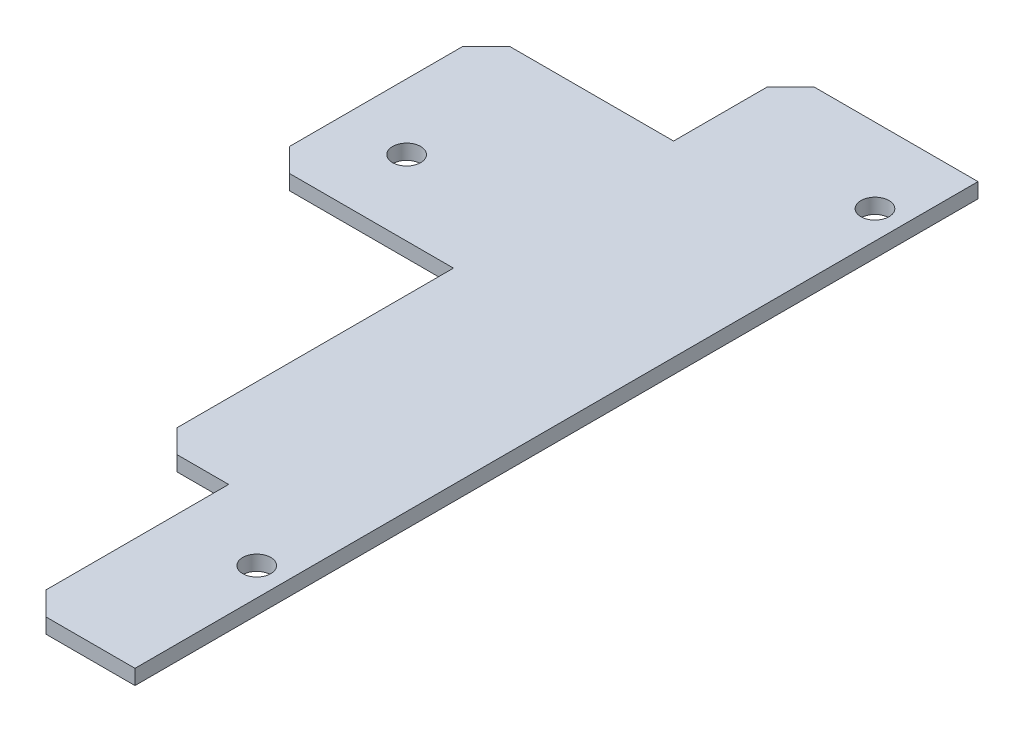
ISO-10303-21;
HEADER;
FILE_DESCRIPTION(('STEP AP214'),'2;1');
FILE_NAME('part.step','',(''),(''),'','','');
FILE_SCHEMA(('AUTOMOTIVE_DESIGN { 1 0 10303 214 1 1 1 1 }'));
ENDSEC;
DATA;
#1=APPLICATION_CONTEXT('core data for automotive mechanical design processes');
#2=APPLICATION_PROTOCOL_DEFINITION('international standard','automotive_design',2000,#1);
#3=PRODUCT_CONTEXT('',#1,'mechanical');
#4=PRODUCT('Part','Part','',(#3));
#5=PRODUCT_RELATED_PRODUCT_CATEGORY('part','',(#4));
#6=PRODUCT_DEFINITION_FORMATION('','',#4);
#7=PRODUCT_DEFINITION_CONTEXT('part definition',#1,'design');
#8=PRODUCT_DEFINITION('design','',#6,#7);
#9=PRODUCT_DEFINITION_SHAPE('','',#8);
#10=(LENGTH_UNIT() NAMED_UNIT(*) SI_UNIT(.MILLI.,.METRE.));
#11=(NAMED_UNIT(*) PLANE_ANGLE_UNIT() SI_UNIT($,.RADIAN.));
#12=(NAMED_UNIT(*) SI_UNIT($,.STERADIAN.) SOLID_ANGLE_UNIT());
#13=UNCERTAINTY_MEASURE_WITH_UNIT(LENGTH_MEASURE(1.E-05),#10,'distance_accuracy_value','');
#14=(GEOMETRIC_REPRESENTATION_CONTEXT(3) GLOBAL_UNCERTAINTY_ASSIGNED_CONTEXT((#13)) GLOBAL_UNIT_ASSIGNED_CONTEXT((#10,
#11,#12)) REPRESENTATION_CONTEXT('',''));
#15=CARTESIAN_POINT('',(0.,0.,0.));
#16=DIRECTION('',(0.,0.,1.));
#17=DIRECTION('',(1.,0.,0.));
#18=AXIS2_PLACEMENT_3D('',#15,#16,#17);
#19=CARTESIAN_POINT('',(-20.,1.6,-36.));
#20=DIRECTION('',(1.,0.,0.));
#21=DIRECTION('',(0.,0.,-1.));
#22=AXIS2_PLACEMENT_3D('',#19,#20,#21);
#23=PLANE('',#22);
#24=DIRECTION('',(0.,0.,1.));
#25=VECTOR('',#24,1.);
#26=CARTESIAN_POINT('',(-20.,1.6,-36.));
#27=LINE('',#26,#25);
#28=CARTESIAN_POINT('',(-20.,1.6,-21.));
#29=VERTEX_POINT('',#28);
#30=CARTESIAN_POINT('',(-20.,1.6,-2.5));
#31=VERTEX_POINT('',#30);
#32=EDGE_CURVE('E189',#29,#31,#27,.T.);
#33=ORIENTED_EDGE('',*,*,#32,.F.);
#34=DIRECTION('',(0.,-1.,0.));
#35=VECTOR('',#34,1.);
#36=CARTESIAN_POINT('',(-20.,1.6,-21.));
#37=LINE('',#36,#35);
#38=CARTESIAN_POINT('',(-20.,0.,-21.));
#39=VERTEX_POINT('',#38);
#40=EDGE_CURVE('E55',#29,#39,#37,.T.);
#41=ORIENTED_EDGE('',*,*,#40,.T.);
#42=DIRECTION('',(0.,0.,1.));
#43=VECTOR('',#42,1.);
#44=CARTESIAN_POINT('',(-20.,0.,-36.));
#45=LINE('',#44,#43);
#46=CARTESIAN_POINT('',(-20.,0.,-2.5));
#47=VERTEX_POINT('',#46);
#48=EDGE_CURVE('E186',#39,#47,#45,.T.);
#49=ORIENTED_EDGE('',*,*,#48,.T.);
#50=DIRECTION('',(0.,1.,0.));
#51=VECTOR('',#50,1.);
#52=CARTESIAN_POINT('',(-20.,1.6,-2.5));
#53=LINE('',#52,#51);
#54=EDGE_CURVE('E262',#47,#31,#53,.T.);
#55=ORIENTED_EDGE('',*,*,#54,.T.);
#56=EDGE_LOOP('',(#33,#41,#49,#55));
#57=FACE_BOUND('',#56,.T.);
#58=ADVANCED_FACE('F33',(#57),#23,.F.);
#59=CARTESIAN_POINT('',(-20.,1.6,0.));
#60=DIRECTION('',(0.,0.,-1.));
#61=DIRECTION('',(-1.,0.,0.));
#62=AXIS2_PLACEMENT_3D('',#59,#60,#61);
#63=PLANE('',#62);
#64=DIRECTION('',(1.,0.,0.));
#65=VECTOR('',#64,1.);
#66=CARTESIAN_POINT('',(-20.,1.6,0.));
#67=LINE('',#66,#65);
#68=CARTESIAN_POINT('',(-17.5,1.6,0.));
#69=VERTEX_POINT('',#68);
#70=CARTESIAN_POINT('',(0.,1.6,0.));
#71=VERTEX_POINT('',#70);
#72=EDGE_CURVE('E192',#69,#71,#67,.T.);
#73=ORIENTED_EDGE('',*,*,#72,.F.);
#74=DIRECTION('',(0.,-1.,0.));
#75=VECTOR('',#74,1.);
#76=CARTESIAN_POINT('',(-17.5,1.6,0.));
#77=LINE('',#76,#75);
#78=CARTESIAN_POINT('',(-17.5,0.,0.));
#79=VERTEX_POINT('',#78);
#80=EDGE_CURVE('E11',#69,#79,#77,.T.);
#81=ORIENTED_EDGE('',*,*,#80,.T.);
#82=DIRECTION('',(1.,0.,0.));
#83=VECTOR('',#82,1.);
#84=CARTESIAN_POINT('',(-20.,0.,0.));
#85=LINE('',#84,#83);
#86=CARTESIAN_POINT('',(0.,0.,0.));
#87=VERTEX_POINT('',#86);
#88=EDGE_CURVE('E211',#79,#87,#85,.T.);
#89=ORIENTED_EDGE('',*,*,#88,.T.);
#90=DIRECTION('',(0.,-1.,0.));
#91=VECTOR('',#90,1.);
#92=CARTESIAN_POINT('',(0.,1.6,0.));
#93=LINE('',#92,#91);
#94=EDGE_CURVE('E235',#71,#87,#93,.T.);
#95=ORIENTED_EDGE('',*,*,#94,.F.);
#96=EDGE_LOOP('',(#73,#81,#89,#95));
#97=FACE_BOUND('',#96,.T.);
#98=ADVANCED_FACE('F324',(#97),#63,.F.);
#99=CARTESIAN_POINT('',(0.,1.6,0.));
#100=DIRECTION('',(1.,0.,0.));
#101=DIRECTION('',(0.,0.,-1.));
#102=AXIS2_PLACEMENT_3D('',#99,#100,#101);
#103=PLANE('',#102);
#104=DIRECTION('',(0.,0.,1.));
#105=VECTOR('',#104,1.);
#106=CARTESIAN_POINT('',(0.,0.,0.));
#107=LINE('',#106,#105);
#108=CARTESIAN_POINT('',(0.,0.,29.5));
#109=VERTEX_POINT('',#108);
#110=EDGE_CURVE('E213',#87,#109,#107,.T.);
#111=ORIENTED_EDGE('',*,*,#110,.T.);
#112=DIRECTION('',(0.,1.,0.));
#113=VECTOR('',#112,1.);
#114=CARTESIAN_POINT('',(0.,1.6,29.5));
#115=LINE('',#114,#113);
#116=CARTESIAN_POINT('',(0.,1.6,29.5));
#117=VERTEX_POINT('',#116);
#118=EDGE_CURVE('E41',#109,#117,#115,.T.);
#119=ORIENTED_EDGE('',*,*,#118,.T.);
#120=DIRECTION('',(0.,0.,1.));
#121=VECTOR('',#120,1.);
#122=CARTESIAN_POINT('',(0.,1.6,0.));
#123=LINE('',#122,#121);
#124=EDGE_CURVE('E195',#71,#117,#123,.T.);
#125=ORIENTED_EDGE('',*,*,#124,.F.);
#126=ORIENTED_EDGE('',*,*,#94,.T.);
#127=EDGE_LOOP('',(#111,#119,#125,#126));
#128=FACE_BOUND('',#127,.T.);
#129=ADVANCED_FACE('F275',(#128),#103,.F.);
#130=CARTESIAN_POINT('',(0.,1.6,32.));
#131=DIRECTION('',(0.,0.,-1.));
#132=DIRECTION('',(-1.,0.,0.));
#133=AXIS2_PLACEMENT_3D('',#130,#131,#132);
#134=PLANE('',#133);
#135=DIRECTION('',(1.,0.,0.));
#136=VECTOR('',#135,1.);
#137=CARTESIAN_POINT('',(0.,1.6,32.));
#138=LINE('',#137,#136);
#139=CARTESIAN_POINT('',(2.5,1.6,32.));
#140=VERTEX_POINT('',#139);
#141=CARTESIAN_POINT('',(8.,1.6,32.));
#142=VERTEX_POINT('',#141);
#143=EDGE_CURVE('E198',#140,#142,#138,.T.);
#144=ORIENTED_EDGE('',*,*,#143,.F.);
#145=DIRECTION('',(0.,-1.,0.));
#146=VECTOR('',#145,1.);
#147=CARTESIAN_POINT('',(2.49999999999999,1.6,32.));
#148=LINE('',#147,#146);
#149=CARTESIAN_POINT('',(2.49999999999999,0.,32.));
#150=VERTEX_POINT('',#149);
#151=EDGE_CURVE('E270',#140,#150,#148,.T.);
#152=ORIENTED_EDGE('',*,*,#151,.T.);
#153=DIRECTION('',(1.,0.,0.));
#154=VECTOR('',#153,1.);
#155=CARTESIAN_POINT('',(0.,0.,32.));
#156=LINE('',#155,#154);
#157=CARTESIAN_POINT('',(8.,0.,32.));
#158=VERTEX_POINT('',#157);
#159=EDGE_CURVE('E216',#150,#158,#156,.T.);
#160=ORIENTED_EDGE('',*,*,#159,.T.);
#161=DIRECTION('',(0.,-1.,0.));
#162=VECTOR('',#161,1.);
#163=CARTESIAN_POINT('',(8.,1.6,32.));
#164=LINE('',#163,#162);
#165=EDGE_CURVE('E232',#142,#158,#164,.T.);
#166=ORIENTED_EDGE('',*,*,#165,.F.);
#167=EDGE_LOOP('',(#144,#152,#160,#166));
#168=FACE_BOUND('',#167,.T.);
#169=ADVANCED_FACE('F286',(#168),#134,.F.);
#170=CARTESIAN_POINT('',(8.,1.6,32.));
#171=DIRECTION('',(1.,0.,0.));
#172=DIRECTION('',(0.,0.,-1.));
#173=AXIS2_PLACEMENT_3D('',#170,#171,#172);
#174=PLANE('',#173);
#175=DIRECTION('',(0.,0.,1.));
#176=VECTOR('',#175,1.);
#177=CARTESIAN_POINT('',(8.,0.,32.));
#178=LINE('',#177,#176);
#179=CARTESIAN_POINT('',(8.,0.,51.5));
#180=VERTEX_POINT('',#179);
#181=EDGE_CURVE('E218',#158,#180,#178,.T.);
#182=ORIENTED_EDGE('',*,*,#181,.T.);
#183=DIRECTION('',(0.,1.,0.));
#184=VECTOR('',#183,1.);
#185=CARTESIAN_POINT('',(8.,1.6,51.5));
#186=LINE('',#185,#184);
#187=CARTESIAN_POINT('',(8.00000000000001,1.6,51.5));
#188=VERTEX_POINT('',#187);
#189=EDGE_CURVE('E268',#180,#188,#186,.T.);
#190=ORIENTED_EDGE('',*,*,#189,.T.);
#191=DIRECTION('',(0.,0.,1.));
#192=VECTOR('',#191,1.);
#193=CARTESIAN_POINT('',(8.,1.6,32.));
#194=LINE('',#193,#192);
#195=EDGE_CURVE('E200',#142,#188,#194,.T.);
#196=ORIENTED_EDGE('',*,*,#195,.F.);
#197=ORIENTED_EDGE('',*,*,#165,.T.);
#198=EDGE_LOOP('',(#182,#190,#196,#197));
#199=FACE_BOUND('',#198,.T.);
#200=ADVANCED_FACE('F293',(#199),#174,.F.);
#201=CARTESIAN_POINT('',(20.,1.6,54.));
#202=DIRECTION('',(0.,0.,-1.));
#203=DIRECTION('',(-1.,0.,0.));
#204=AXIS2_PLACEMENT_3D('',#201,#202,#203);
#205=PLANE('',#204);
#206=DIRECTION('',(1.,0.,0.));
#207=VECTOR('',#206,1.);
#208=CARTESIAN_POINT('',(20.,1.6,54.));
#209=LINE('',#208,#207);
#210=CARTESIAN_POINT('',(10.5,1.6,54.));
#211=VERTEX_POINT('',#210);
#212=CARTESIAN_POINT('',(20.,1.6,54.));
#213=VERTEX_POINT('',#212);
#214=EDGE_CURVE('E203',#211,#213,#209,.T.);
#215=ORIENTED_EDGE('',*,*,#214,.F.);
#216=DIRECTION('',(0.,-1.,0.));
#217=VECTOR('',#216,1.);
#218=CARTESIAN_POINT('',(10.5,1.6,54.));
#219=LINE('',#218,#217);
#220=CARTESIAN_POINT('',(10.5,0.,54.));
#221=VERTEX_POINT('',#220);
#222=EDGE_CURVE('E265',#211,#221,#219,.T.);
#223=ORIENTED_EDGE('',*,*,#222,.T.);
#224=DIRECTION('',(1.,0.,0.));
#225=VECTOR('',#224,1.);
#226=CARTESIAN_POINT('',(20.,0.,54.));
#227=LINE('',#226,#225);
#228=CARTESIAN_POINT('',(20.,0.,54.));
#229=VERTEX_POINT('',#228);
#230=EDGE_CURVE('E221',#221,#229,#227,.T.);
#231=ORIENTED_EDGE('',*,*,#230,.T.);
#232=DIRECTION('',(0.,-1.,0.));
#233=VECTOR('',#232,1.);
#234=CARTESIAN_POINT('',(20.,1.6,54.));
#235=LINE('',#234,#233);
#236=EDGE_CURVE('E229',#213,#229,#235,.T.);
#237=ORIENTED_EDGE('',*,*,#236,.F.);
#238=EDGE_LOOP('',(#215,#223,#231,#237));
#239=FACE_BOUND('',#238,.T.);
#240=ADVANCED_FACE('F302',(#239),#205,.F.);
#241=CARTESIAN_POINT('',(20.,1.6,-36.));
#242=DIRECTION('',(-1.,0.,0.));
#243=DIRECTION('',(0.,0.,1.));
#244=AXIS2_PLACEMENT_3D('',#241,#242,#243);
#245=PLANE('',#244);
#246=DIRECTION('',(0.,0.,-1.));
#247=VECTOR('',#246,1.);
#248=CARTESIAN_POINT('',(20.,0.,-36.));
#249=LINE('',#248,#247);
#250=CARTESIAN_POINT('',(20.,0.,-36.));
#251=VERTEX_POINT('',#250);
#252=EDGE_CURVE('E223',#229,#251,#249,.T.);
#253=ORIENTED_EDGE('',*,*,#252,.T.);
#254=DIRECTION('',(0.,-1.,0.));
#255=VECTOR('',#254,1.);
#256=CARTESIAN_POINT('',(20.,1.6,-36.));
#257=LINE('',#256,#255);
#258=CARTESIAN_POINT('',(20.,1.6,-36.));
#259=VERTEX_POINT('',#258);
#260=EDGE_CURVE('E209',#259,#251,#257,.T.);
#261=ORIENTED_EDGE('',*,*,#260,.F.);
#262=DIRECTION('',(0.,0.,-1.));
#263=VECTOR('',#262,1.);
#264=CARTESIAN_POINT('',(20.,1.6,-36.));
#265=LINE('',#264,#263);
#266=EDGE_CURVE('E205',#213,#259,#265,.T.);
#267=ORIENTED_EDGE('',*,*,#266,.F.);
#268=ORIENTED_EDGE('',*,*,#236,.T.);
#269=EDGE_LOOP('',(#253,#261,#267,#268));
#270=FACE_BOUND('',#269,.T.);
#271=ADVANCED_FACE('F307',(#270),#245,.F.);
#272=CARTESIAN_POINT('',(-20.,1.6,-36.));
#273=DIRECTION('',(0.,0.,1.));
#274=DIRECTION('',(1.,0.,0.));
#275=AXIS2_PLACEMENT_3D('',#272,#273,#274);
#276=PLANE('',#275);
#277=DIRECTION('',(-1.,0.,0.));
#278=VECTOR('',#277,1.);
#279=CARTESIAN_POINT('',(-20.,0.,-36.));
#280=LINE('',#279,#278);
#281=CARTESIAN_POINT('',(2.50000000000001,0.,-36.));
#282=VERTEX_POINT('',#281);
#283=EDGE_CURVE('E193',#251,#282,#280,.T.);
#284=ORIENTED_EDGE('',*,*,#283,.T.);
#285=DIRECTION('',(0.,1.,0.));
#286=VECTOR('',#285,1.);
#287=CARTESIAN_POINT('',(2.50000000000002,1.6,-36.));
#288=LINE('',#287,#286);
#289=CARTESIAN_POINT('',(2.50000000000001,1.6,-36.));
#290=VERTEX_POINT('',#289);
#291=EDGE_CURVE('E238',#282,#290,#288,.T.);
#292=ORIENTED_EDGE('',*,*,#291,.T.);
#293=DIRECTION('',(-1.,0.,0.));
#294=VECTOR('',#293,1.);
#295=CARTESIAN_POINT('',(-20.,1.6,-36.));
#296=LINE('',#295,#294);
#297=EDGE_CURVE('E207',#259,#290,#296,.T.);
#298=ORIENTED_EDGE('',*,*,#297,.F.);
#299=ORIENTED_EDGE('',*,*,#260,.T.);
#300=EDGE_LOOP('',(#284,#292,#298,#299));
#301=FACE_BOUND('',#300,.T.);
#302=ADVANCED_FACE('F310',(#301),#276,.F.);
#303=CARTESIAN_POINT('',(-20.,1.6,0.));
#304=DIRECTION('',(0.,1.,0.));
#305=DIRECTION('',(0.,0.,1.));
#306=AXIS2_PLACEMENT_3D('',#303,#304,#305);
#307=PLANE('',#306);
#308=ORIENTED_EDGE('',*,*,#297,.T.);
#309=DIRECTION('',(0.707106781186548,0.,-0.707106781186548));
#310=VECTOR('',#309,1.);
#311=CARTESIAN_POINT('',(-26.75,1.6,-6.74999999999999));
#312=LINE('',#311,#310);
#313=CARTESIAN_POINT('',(0.,1.6,-33.5));
#314=VERTEX_POINT('',#313);
#315=EDGE_CURVE('E165',#290,#314,#312,.F.);
#316=ORIENTED_EDGE('',*,*,#315,.T.);
#317=DIRECTION('',(0.,0.,-1.));
#318=VECTOR('',#317,1.);
#319=CARTESIAN_POINT('',(0.,1.6,-36.));
#320=LINE('',#319,#318);
#321=CARTESIAN_POINT('',(0.,1.6,-23.5));
#322=VERTEX_POINT('',#321);
#323=EDGE_CURVE('E151',#322,#314,#320,.T.);
#324=ORIENTED_EDGE('',*,*,#323,.F.);
#325=DIRECTION('',(1.,0.,0.));
#326=VECTOR('',#325,1.);
#327=CARTESIAN_POINT('',(-20.,1.6,-23.5));
#328=LINE('',#327,#326);
#329=CARTESIAN_POINT('',(-17.5,1.6,-23.5));
#330=VERTEX_POINT('',#329);
#331=EDGE_CURVE('E142',#330,#322,#328,.T.);
#332=ORIENTED_EDGE('',*,*,#331,.F.);
#333=DIRECTION('',(0.707106781186546,0.,-0.707106781186549));
#334=VECTOR('',#333,1.);
#335=CARTESIAN_POINT('',(-30.5,1.6,-10.4999999999999));
#336=LINE('',#335,#334);
#337=EDGE_CURVE('E247',#330,#29,#336,.F.);
#338=ORIENTED_EDGE('',*,*,#337,.T.);
#339=ORIENTED_EDGE('',*,*,#32,.T.);
#340=DIRECTION('',(-0.707106781186546,0.,-0.707106781186549));
#341=VECTOR('',#340,1.);
#342=CARTESIAN_POINT('',(-18.75,1.6,-1.24999999999999));
#343=LINE('',#342,#341);
#344=EDGE_CURVE('E241',#31,#69,#343,.F.);
#345=ORIENTED_EDGE('',*,*,#344,.T.);
#346=ORIENTED_EDGE('',*,*,#72,.T.);
#347=ORIENTED_EDGE('',*,*,#124,.T.);
#348=DIRECTION('',(-0.707106781186548,0.,-0.707106781186548));
#349=VECTOR('',#348,1.);
#350=CARTESIAN_POINT('',(-24.75,1.6,4.74999999999999));
#351=LINE('',#350,#349);
#352=EDGE_CURVE('E243',#117,#140,#351,.F.);
#353=ORIENTED_EDGE('',*,*,#352,.T.);
#354=ORIENTED_EDGE('',*,*,#143,.T.);
#355=ORIENTED_EDGE('',*,*,#195,.T.);
#356=DIRECTION('',(-0.707106781186544,0.,-0.707106781186551));
#357=VECTOR('',#356,1.);
#358=CARTESIAN_POINT('',(-31.7499999999998,1.6,11.7499999999997));
#359=LINE('',#358,#357);
#360=EDGE_CURVE('E245',#188,#211,#359,.F.);
#361=ORIENTED_EDGE('',*,*,#360,.T.);
#362=ORIENTED_EDGE('',*,*,#214,.T.);
#363=ORIENTED_EDGE('',*,*,#266,.T.);
#364=EDGE_LOOP('',(#308,#316,#324,#332,#338,#339,#345,#346,#347,#353,#354,#355,#361,#362,#363));
#365=FACE_BOUND('',#364,.T.);
#366=CARTESIAN_POINT('',(17.,1.6,38.));
#367=DIRECTION('',(0.,1.,0.));
#368=DIRECTION('',(0.,0.,1.));
#369=AXIS2_PLACEMENT_3D('',#366,#367,#368);
#370=CIRCLE('',#369,1.5);
#371=CARTESIAN_POINT('',(17.,1.6,39.5));
#372=VERTEX_POINT('',#371);
#373=EDGE_CURVE('E160',#372,#372,#370,.T.);
#374=ORIENTED_EDGE('',*,*,#373,.F.);
#375=EDGE_LOOP('',(#374));
#376=FACE_BOUND('',#375,.T.);
#377=CARTESIAN_POINT('',(-13.,1.6,-8.00000000000001));
#378=DIRECTION('',(0.,1.,0.));
#379=DIRECTION('',(0.,0.,1.));
#380=AXIS2_PLACEMENT_3D('',#377,#378,#379);
#381=CIRCLE('',#380,1.5);
#382=CARTESIAN_POINT('',(-13.,1.6,-6.50000000000001));
#383=VERTEX_POINT('',#382);
#384=EDGE_CURVE('E174',#383,#383,#381,.T.);
#385=ORIENTED_EDGE('',*,*,#384,.F.);
#386=EDGE_LOOP('',(#385));
#387=FACE_BOUND('',#386,.T.);
#388=CARTESIAN_POINT('',(17.,1.6,-28.));
#389=DIRECTION('',(0.,1.,0.));
#390=DIRECTION('',(0.,0.,1.));
#391=AXIS2_PLACEMENT_3D('',#388,#389,#390);
#392=CIRCLE('',#391,1.5);
#393=CARTESIAN_POINT('',(17.,1.6,-26.5));
#394=VERTEX_POINT('',#393);
#395=EDGE_CURVE('E180',#394,#394,#392,.T.);
#396=ORIENTED_EDGE('',*,*,#395,.F.);
#397=EDGE_LOOP('',(#396));
#398=FACE_BOUND('',#397,.T.);
#399=ADVANCED_FACE('F163',(#365,#376,#387,#398),#307,.T.);
#400=CARTESIAN_POINT('',(-20.,0.,0.));
#401=DIRECTION('',(0.,1.,0.));
#402=DIRECTION('',(0.,0.,1.));
#403=AXIS2_PLACEMENT_3D('',#400,#401,#402);
#404=PLANE('',#403);
#405=CARTESIAN_POINT('',(17.,0.,38.));
#406=DIRECTION('',(0.,1.,0.));
#407=DIRECTION('',(0.,0.,1.));
#408=AXIS2_PLACEMENT_3D('',#405,#406,#407);
#409=CIRCLE('',#408,1.5);
#410=CARTESIAN_POINT('',(17.,0.,39.5));
#411=VERTEX_POINT('',#410);
#412=EDGE_CURVE('E171',#411,#411,#409,.T.);
#413=ORIENTED_EDGE('',*,*,#412,.T.);
#414=EDGE_LOOP('',(#413));
#415=FACE_BOUND('',#414,.T.);
#416=CARTESIAN_POINT('',(-13.,0.,-8.00000000000001));
#417=DIRECTION('',(0.,1.,0.));
#418=DIRECTION('',(0.,0.,1.));
#419=AXIS2_PLACEMENT_3D('',#416,#417,#418);
#420=CIRCLE('',#419,1.5);
#421=CARTESIAN_POINT('',(-13.,0.,-6.50000000000001));
#422=VERTEX_POINT('',#421);
#423=EDGE_CURVE('E177',#422,#422,#420,.T.);
#424=ORIENTED_EDGE('',*,*,#423,.T.);
#425=EDGE_LOOP('',(#424));
#426=FACE_BOUND('',#425,.T.);
#427=CARTESIAN_POINT('',(17.,0.,-28.));
#428=DIRECTION('',(0.,1.,0.));
#429=DIRECTION('',(0.,0.,1.));
#430=AXIS2_PLACEMENT_3D('',#427,#428,#429);
#431=CIRCLE('',#430,1.5);
#432=CARTESIAN_POINT('',(17.,0.,-26.5));
#433=VERTEX_POINT('',#432);
#434=EDGE_CURVE('E183',#433,#433,#431,.T.);
#435=ORIENTED_EDGE('',*,*,#434,.T.);
#436=EDGE_LOOP('',(#435));
#437=FACE_BOUND('',#436,.T.);
#438=DIRECTION('',(0.,0.,-1.));
#439=VECTOR('',#438,1.);
#440=CARTESIAN_POINT('',(0.,0.,-36.));
#441=LINE('',#440,#439);
#442=CARTESIAN_POINT('',(0.,0.,-23.5));
#443=VERTEX_POINT('',#442);
#444=CARTESIAN_POINT('',(0.,0.,-33.5));
#445=VERTEX_POINT('',#444);
#446=EDGE_CURVE('E159',#443,#445,#441,.T.);
#447=ORIENTED_EDGE('',*,*,#446,.T.);
#448=DIRECTION('',(-0.707106781186548,0.,0.707106781186548));
#449=VECTOR('',#448,1.);
#450=CARTESIAN_POINT('',(2.50000000000002,0.,-36.));
#451=LINE('',#450,#449);
#452=EDGE_CURVE('E259',#445,#282,#451,.F.);
#453=ORIENTED_EDGE('',*,*,#452,.T.);
#454=ORIENTED_EDGE('',*,*,#283,.F.);
#455=ORIENTED_EDGE('',*,*,#252,.F.);
#456=ORIENTED_EDGE('',*,*,#230,.F.);
#457=DIRECTION('',(0.707106781186544,0.,0.707106781186551));
#458=VECTOR('',#457,1.);
#459=CARTESIAN_POINT('',(10.5,0.,54.));
#460=LINE('',#459,#458);
#461=EDGE_CURVE('E255',#221,#180,#460,.F.);
#462=ORIENTED_EDGE('',*,*,#461,.T.);
#463=ORIENTED_EDGE('',*,*,#181,.F.);
#464=ORIENTED_EDGE('',*,*,#159,.F.);
#465=DIRECTION('',(0.707106781186548,0.,0.707106781186548));
#466=VECTOR('',#465,1.);
#467=CARTESIAN_POINT('',(2.49999999999999,0.,32.));
#468=LINE('',#467,#466);
#469=EDGE_CURVE('E253',#150,#109,#468,.F.);
#470=ORIENTED_EDGE('',*,*,#469,.T.);
#471=ORIENTED_EDGE('',*,*,#110,.F.);
#472=ORIENTED_EDGE('',*,*,#88,.F.);
#473=DIRECTION('',(0.707106781186546,0.,0.707106781186549));
#474=VECTOR('',#473,1.);
#475=CARTESIAN_POINT('',(-17.5,0.,0.));
#476=LINE('',#475,#474);
#477=EDGE_CURVE('E48',#79,#47,#476,.F.);
#478=ORIENTED_EDGE('',*,*,#477,.T.);
#479=ORIENTED_EDGE('',*,*,#48,.F.);
#480=DIRECTION('',(-0.707106781186546,0.,0.707106781186549));
#481=VECTOR('',#480,1.);
#482=CARTESIAN_POINT('',(-17.5,0.,-23.5));
#483=LINE('',#482,#481);
#484=CARTESIAN_POINT('',(-17.5,0.,-23.5));
#485=VERTEX_POINT('',#484);
#486=EDGE_CURVE('E257',#39,#485,#483,.F.);
#487=ORIENTED_EDGE('',*,*,#486,.T.);
#488=DIRECTION('',(1.,0.,0.));
#489=VECTOR('',#488,1.);
#490=CARTESIAN_POINT('',(-20.,0.,-23.5));
#491=LINE('',#490,#489);
#492=EDGE_CURVE('E166',#485,#443,#491,.T.);
#493=ORIENTED_EDGE('',*,*,#492,.T.);
#494=EDGE_LOOP('',(#447,#453,#454,#455,#456,#462,#463,#464,#470,#471,#472,#478,#479,#487,#493));
#495=FACE_BOUND('',#494,.T.);
#496=ADVANCED_FACE('F289',(#415,#426,#437,#495),#404,.F.);
#497=CARTESIAN_POINT('',(17.,0.,-28.));
#498=DIRECTION('',(0.,1.,0.));
#499=DIRECTION('',(0.,0.,1.));
#500=AXIS2_PLACEMENT_3D('',#497,#498,#499);
#501=CYLINDRICAL_SURFACE('',#500,1.5);
#502=ORIENTED_EDGE('',*,*,#434,.F.);
#503=EDGE_LOOP('',(#502));
#504=FACE_BOUND('',#503,.T.);
#505=ORIENTED_EDGE('',*,*,#395,.T.);
#506=EDGE_LOOP('',(#505));
#507=FACE_BOUND('',#506,.T.);
#508=ADVANCED_FACE('F396',(#504,#507),#501,.F.);
#509=CARTESIAN_POINT('',(-13.,0.,-8.00000000000001));
#510=DIRECTION('',(0.,1.,0.));
#511=DIRECTION('',(0.,0.,1.));
#512=AXIS2_PLACEMENT_3D('',#509,#510,#511);
#513=CYLINDRICAL_SURFACE('',#512,1.5);
#514=ORIENTED_EDGE('',*,*,#423,.F.);
#515=EDGE_LOOP('',(#514));
#516=FACE_BOUND('',#515,.T.);
#517=ORIENTED_EDGE('',*,*,#384,.T.);
#518=EDGE_LOOP('',(#517));
#519=FACE_BOUND('',#518,.T.);
#520=ADVANCED_FACE('F463',(#516,#519),#513,.F.);
#521=CARTESIAN_POINT('',(17.,0.,38.));
#522=DIRECTION('',(0.,1.,0.));
#523=DIRECTION('',(0.,0.,1.));
#524=AXIS2_PLACEMENT_3D('',#521,#522,#523);
#525=CYLINDRICAL_SURFACE('',#524,1.5);
#526=ORIENTED_EDGE('',*,*,#412,.F.);
#527=EDGE_LOOP('',(#526));
#528=FACE_BOUND('',#527,.T.);
#529=ORIENTED_EDGE('',*,*,#373,.T.);
#530=EDGE_LOOP('',(#529));
#531=FACE_BOUND('',#530,.T.);
#532=ADVANCED_FACE('F385',(#528,#531),#525,.F.);
#533=CARTESIAN_POINT('',(0.,0.,-36.));
#534=DIRECTION('',(1.,0.,0.));
#535=DIRECTION('',(0.,0.,-1.));
#536=AXIS2_PLACEMENT_3D('',#533,#534,#535);
#537=PLANE('',#536);
#538=ORIENTED_EDGE('',*,*,#323,.T.);
#539=DIRECTION('',(0.,-1.,0.));
#540=VECTOR('',#539,1.);
#541=CARTESIAN_POINT('',(0.,0.,-33.5));
#542=LINE('',#541,#540);
#543=EDGE_CURVE('E250',#314,#445,#542,.T.);
#544=ORIENTED_EDGE('',*,*,#543,.T.);
#545=ORIENTED_EDGE('',*,*,#446,.F.);
#546=DIRECTION('',(0.,1.,0.));
#547=VECTOR('',#546,1.);
#548=CARTESIAN_POINT('',(0.,0.,-23.5));
#549=LINE('',#548,#547);
#550=EDGE_CURVE('E146',#443,#322,#549,.T.);
#551=ORIENTED_EDGE('',*,*,#550,.T.);
#552=EDGE_LOOP('',(#538,#544,#545,#551));
#553=FACE_BOUND('',#552,.T.);
#554=ADVANCED_FACE('F156',(#553),#537,.F.);
#555=CARTESIAN_POINT('',(-20.,0.,-23.5));
#556=DIRECTION('',(0.,0.,1.));
#557=DIRECTION('',(1.,0.,0.));
#558=AXIS2_PLACEMENT_3D('',#555,#556,#557);
#559=PLANE('',#558);
#560=ORIENTED_EDGE('',*,*,#492,.F.);
#561=DIRECTION('',(0.,1.,0.));
#562=VECTOR('',#561,1.);
#563=CARTESIAN_POINT('',(-17.5,0.,-23.5));
#564=LINE('',#563,#562);
#565=EDGE_CURVE('E148',#485,#330,#564,.T.);
#566=ORIENTED_EDGE('',*,*,#565,.T.);
#567=ORIENTED_EDGE('',*,*,#331,.T.);
#568=ORIENTED_EDGE('',*,*,#550,.F.);
#569=EDGE_LOOP('',(#560,#566,#567,#568));
#570=FACE_BOUND('',#569,.T.);
#571=ADVANCED_FACE('F145',(#570),#559,.F.);
#572=CARTESIAN_POINT('',(2.50000000000002,1.6,-36.));
#573=DIRECTION('',(0.707106781186547,0.,0.707106781186547));
#574=DIRECTION('',(0.707106781186548,0.,-0.707106781186548));
#575=AXIS2_PLACEMENT_3D('',#572,#573,#574);
#576=PLANE('',#575);
#577=ORIENTED_EDGE('',*,*,#452,.F.);
#578=ORIENTED_EDGE('',*,*,#543,.F.);
#579=ORIENTED_EDGE('',*,*,#315,.F.);
#580=ORIENTED_EDGE('',*,*,#291,.F.);
#581=EDGE_LOOP('',(#577,#578,#579,#580));
#582=FACE_BOUND('',#581,.T.);
#583=ADVANCED_FACE('F315',(#582),#576,.F.);
#584=CARTESIAN_POINT('',(-17.5,0.,-23.5));
#585=DIRECTION('',(0.707106781186549,0.,0.707106781186545));
#586=DIRECTION('',(0.707106781186546,0.,-0.707106781186549));
#587=AXIS2_PLACEMENT_3D('',#584,#585,#586);
#588=PLANE('',#587);
#589=ORIENTED_EDGE('',*,*,#486,.F.);
#590=ORIENTED_EDGE('',*,*,#40,.F.);
#591=ORIENTED_EDGE('',*,*,#337,.F.);
#592=ORIENTED_EDGE('',*,*,#565,.F.);
#593=EDGE_LOOP('',(#589,#590,#591,#592));
#594=FACE_BOUND('',#593,.T.);
#595=ADVANCED_FACE('F318',(#594),#588,.F.);
#596=CARTESIAN_POINT('',(10.5,1.6,54.));
#597=DIRECTION('',(0.707106781186551,0.,-0.707106781186543));
#598=DIRECTION('',(-0.707106781186544,0.,-0.707106781186551));
#599=AXIS2_PLACEMENT_3D('',#596,#597,#598);
#600=PLANE('',#599);
#601=ORIENTED_EDGE('',*,*,#360,.F.);
#602=ORIENTED_EDGE('',*,*,#189,.F.);
#603=ORIENTED_EDGE('',*,*,#461,.F.);
#604=ORIENTED_EDGE('',*,*,#222,.F.);
#605=EDGE_LOOP('',(#601,#602,#603,#604));
#606=FACE_BOUND('',#605,.T.);
#607=ADVANCED_FACE('F297',(#606),#600,.F.);
#608=CARTESIAN_POINT('',(2.49999999999999,1.6,32.));
#609=DIRECTION('',(0.707106781186548,0.,-0.707106781186548));
#610=DIRECTION('',(-0.707106781186548,0.,-0.707106781186548));
#611=AXIS2_PLACEMENT_3D('',#608,#609,#610);
#612=PLANE('',#611);
#613=ORIENTED_EDGE('',*,*,#352,.F.);
#614=ORIENTED_EDGE('',*,*,#118,.F.);
#615=ORIENTED_EDGE('',*,*,#469,.F.);
#616=ORIENTED_EDGE('',*,*,#151,.F.);
#617=EDGE_LOOP('',(#613,#614,#615,#616));
#618=FACE_BOUND('',#617,.T.);
#619=ADVANCED_FACE('F283',(#618),#612,.F.);
#620=CARTESIAN_POINT('',(-17.5,1.6,0.));
#621=DIRECTION('',(0.707106781186549,0.,-0.707106781186546));
#622=DIRECTION('',(-0.707106781186546,0.,-0.707106781186549));
#623=AXIS2_PLACEMENT_3D('',#620,#621,#622);
#624=PLANE('',#623);
#625=ORIENTED_EDGE('',*,*,#344,.F.);
#626=ORIENTED_EDGE('',*,*,#54,.F.);
#627=ORIENTED_EDGE('',*,*,#477,.F.);
#628=ORIENTED_EDGE('',*,*,#80,.F.);
#629=EDGE_LOOP('',(#625,#626,#627,#628));
#630=FACE_BOUND('',#629,.T.);
#631=ADVANCED_FACE('F35',(#630),#624,.F.);
#632=CLOSED_SHELL('',(#58,#98,#129,#169,#200,#240,#271,#302,#399,#496,#508,#520,#532,#554,#571,
#583,#595,#607,#619,#631));
#633=MANIFOLD_SOLID_BREP('B2',#632);
#634=ADVANCED_BREP_SHAPE_REPRESENTATION('',(#18,#633),#14);
#635=SHAPE_DEFINITION_REPRESENTATION(#9,#634);
ENDSEC;
END-ISO-10303-21;
